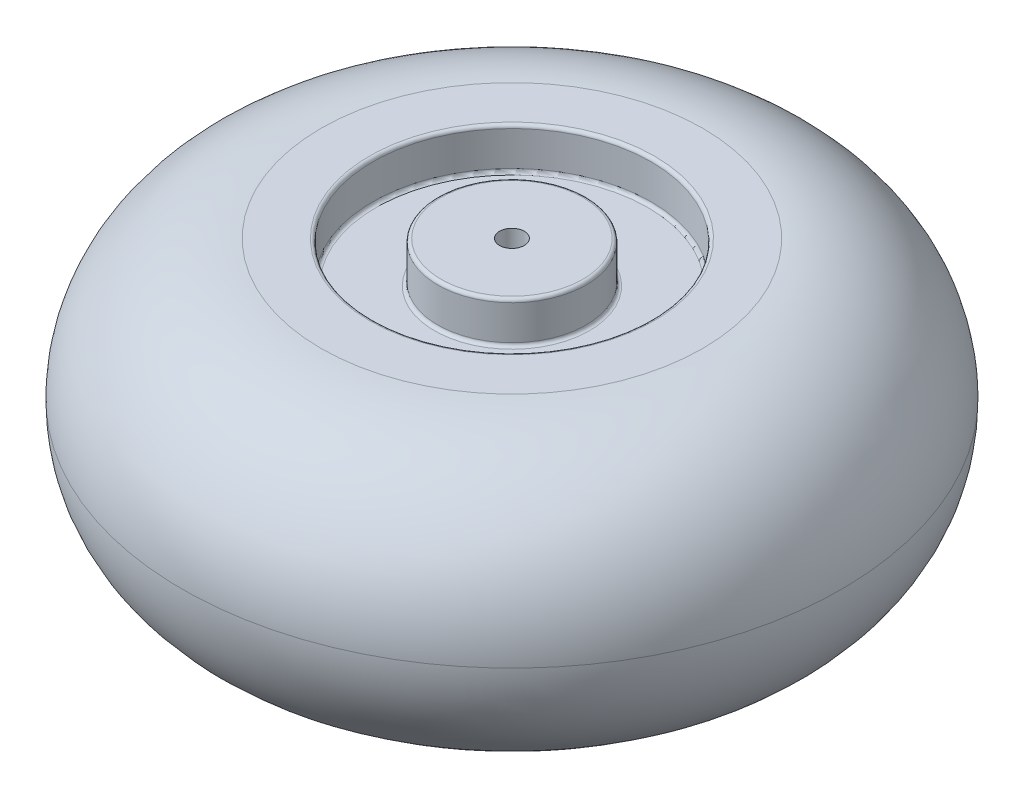
ISO-10303-21;
HEADER;
FILE_DESCRIPTION(('STEP AP214'),'2;1');
FILE_NAME('part.step','',(''),(''),'','','');
FILE_SCHEMA(('AUTOMOTIVE_DESIGN { 1 0 10303 214 1 1 1 1 }'));
ENDSEC;
DATA;
#1=APPLICATION_CONTEXT('core data for automotive mechanical design processes');
#2=APPLICATION_PROTOCOL_DEFINITION('international standard','automotive_design',2000,#1);
#3=PRODUCT_CONTEXT('',#1,'mechanical');
#4=PRODUCT('Part','Part','',(#3));
#5=PRODUCT_RELATED_PRODUCT_CATEGORY('part','',(#4));
#6=PRODUCT_DEFINITION_FORMATION('','',#4);
#7=PRODUCT_DEFINITION_CONTEXT('part definition',#1,'design');
#8=PRODUCT_DEFINITION('design','',#6,#7);
#9=PRODUCT_DEFINITION_SHAPE('','',#8);
#10=(LENGTH_UNIT() NAMED_UNIT(*) SI_UNIT(.MILLI.,.METRE.));
#11=(NAMED_UNIT(*) PLANE_ANGLE_UNIT() SI_UNIT($,.RADIAN.));
#12=(NAMED_UNIT(*) SI_UNIT($,.STERADIAN.) SOLID_ANGLE_UNIT());
#13=UNCERTAINTY_MEASURE_WITH_UNIT(LENGTH_MEASURE(1.E-05),#10,'distance_accuracy_value','');
#14=(GEOMETRIC_REPRESENTATION_CONTEXT(3) GLOBAL_UNCERTAINTY_ASSIGNED_CONTEXT((#13)) GLOBAL_UNIT_ASSIGNED_CONTEXT((#10,
#11,#12)) REPRESENTATION_CONTEXT('',''));
#15=CARTESIAN_POINT('',(0.,0.,0.));
#16=DIRECTION('',(0.,0.,1.));
#17=DIRECTION('',(1.,0.,0.));
#18=AXIS2_PLACEMENT_3D('',#15,#16,#17);
#19=CARTESIAN_POINT('',(0.,67.5,-6.));
#20=DIRECTION('',(0.,1.,0.));
#21=DIRECTION('',(0.,0.,1.));
#22=AXIS2_PLACEMENT_3D('',#19,#20,#21);
#23=PLANE('',#22);
#24=CARTESIAN_POINT('',(0.,67.5,0.));
#25=DIRECTION('',(0.,-1.,0.));
#26=DIRECTION('',(0.,0.,-1.));
#27=AXIS2_PLACEMENT_3D('',#24,#25,#26);
#28=CIRCLE('',#27,6.);
#29=CARTESIAN_POINT('',(0.,67.5,-6.));
#30=VERTEX_POINT('',#29);
#31=EDGE_CURVE('E104',#30,#30,#28,.T.);
#32=ORIENTED_EDGE('',*,*,#31,.T.);
#33=EDGE_LOOP('',(#32));
#34=FACE_BOUND('',#33,.T.);
#35=CARTESIAN_POINT('',(0.,67.5,0.));
#36=DIRECTION('',(0.,-1.,0.));
#37=DIRECTION('',(0.,0.,-1.));
#38=AXIS2_PLACEMENT_3D('',#35,#36,#37);
#39=CIRCLE('',#38,34.3864252617363);
#40=CARTESIAN_POINT('',(0.,67.5,-34.3864252617363));
#41=VERTEX_POINT('',#40);
#42=EDGE_CURVE('E10',#41,#41,#39,.T.);
#43=ORIENTED_EDGE('',*,*,#42,.F.);
#44=EDGE_LOOP('',(#43));
#45=FACE_BOUND('',#44,.T.);
#46=ADVANCED_FACE('F37',(#34,#45),#23,.T.);
#47=CARTESIAN_POINT('',(0.,65.8864252617363,0.));
#48=DIRECTION('',(0.,-1.,0.));
#49=DIRECTION('',(0.,0.,-1.));
#50=AXIS2_PLACEMENT_3D('',#47,#48,#49);
#51=TOROIDAL_SURFACE('',#50,34.3864252617363,1.61357473826371);
#52=ORIENTED_EDGE('',*,*,#42,.T.);
#53=EDGE_LOOP('',(#52));
#54=FACE_BOUND('',#53,.T.);
#55=CARTESIAN_POINT('',(0.,65.8864252617363,0.));
#56=DIRECTION('',(0.,-1.,0.));
#57=DIRECTION('',(0.,0.,-1.));
#58=AXIS2_PLACEMENT_3D('',#55,#56,#57);
#59=CIRCLE('',#58,36.);
#60=CARTESIAN_POINT('',(0.,65.8864252617363,-36.));
#61=VERTEX_POINT('',#60);
#62=EDGE_CURVE('E43',#61,#61,#59,.T.);
#63=ORIENTED_EDGE('',*,*,#62,.F.);
#64=EDGE_LOOP('',(#63));
#65=FACE_BOUND('',#64,.T.);
#66=ADVANCED_FACE('F122',(#54,#65),#51,.T.);
#67=CARTESIAN_POINT('',(0.,0.,0.));
#68=DIRECTION('',(0.,-1.,0.));
#69=DIRECTION('',(0.,0.,-1.));
#70=AXIS2_PLACEMENT_3D('',#67,#68,#69);
#71=CYLINDRICAL_SURFACE('',#70,36.);
#72=ORIENTED_EDGE('',*,*,#62,.T.);
#73=EDGE_LOOP('',(#72));
#74=FACE_BOUND('',#73,.T.);
#75=CARTESIAN_POINT('',(0.,49.1135747382637,0.));
#76=DIRECTION('',(0.,-1.,0.));
#77=DIRECTION('',(0.,0.,-1.));
#78=AXIS2_PLACEMENT_3D('',#75,#76,#77);
#79=CIRCLE('',#78,36.);
#80=CARTESIAN_POINT('',(0.,49.1135747382637,-36.));
#81=VERTEX_POINT('',#80);
#82=EDGE_CURVE('E47',#81,#81,#79,.T.);
#83=ORIENTED_EDGE('',*,*,#82,.F.);
#84=EDGE_LOOP('',(#83));
#85=FACE_BOUND('',#84,.T.);
#86=ADVANCED_FACE('F126',(#74,#85),#71,.T.);
#87=CARTESIAN_POINT('',(0.,49.1135747382637,0.));
#88=DIRECTION('',(0.,-1.,0.));
#89=DIRECTION('',(0.,0.,-1.));
#90=AXIS2_PLACEMENT_3D('',#87,#88,#89);
#91=TOROIDAL_SURFACE('',#90,37.6135747382637,1.6135747382637);
#92=ORIENTED_EDGE('',*,*,#82,.T.);
#93=EDGE_LOOP('',(#92));
#94=FACE_BOUND('',#93,.T.);
#95=CARTESIAN_POINT('',(0.,47.5,0.));
#96=DIRECTION('',(0.,-1.,0.));
#97=DIRECTION('',(0.,0.,-1.));
#98=AXIS2_PLACEMENT_3D('',#95,#96,#97);
#99=CIRCLE('',#98,37.6135747382637);
#100=CARTESIAN_POINT('',(0.,47.5,-37.6135747382637));
#101=VERTEX_POINT('',#100);
#102=EDGE_CURVE('E51',#101,#101,#99,.T.);
#103=ORIENTED_EDGE('',*,*,#102,.F.);
#104=EDGE_LOOP('',(#103));
#105=FACE_BOUND('',#104,.T.);
#106=ADVANCED_FACE('F130',(#94,#105),#91,.F.);
#107=CARTESIAN_POINT('',(0.,47.5,-37.6135747382637));
#108=DIRECTION('',(0.,1.,0.));
#109=DIRECTION('',(0.,0.,1.));
#110=AXIS2_PLACEMENT_3D('',#107,#108,#109);
#111=PLANE('',#110);
#112=ORIENTED_EDGE('',*,*,#102,.T.);
#113=EDGE_LOOP('',(#112));
#114=FACE_BOUND('',#113,.T.);
#115=CARTESIAN_POINT('',(0.,47.5,0.));
#116=DIRECTION('',(0.,-1.,0.));
#117=DIRECTION('',(0.,0.,-1.));
#118=AXIS2_PLACEMENT_3D('',#115,#116,#117);
#119=CIRCLE('',#118,65.9196229294904);
#120=CARTESIAN_POINT('',(0.,47.5,-65.9196229294904));
#121=VERTEX_POINT('',#120);
#122=EDGE_CURVE('E56',#121,#121,#119,.T.);
#123=ORIENTED_EDGE('',*,*,#122,.F.);
#124=EDGE_LOOP('',(#123));
#125=FACE_BOUND('',#124,.T.);
#126=ADVANCED_FACE('F136',(#114,#125),#111,.T.);
#127=CARTESIAN_POINT('',(0.,49.1135747382637,0.));
#128=DIRECTION('',(0.,-1.,0.));
#129=DIRECTION('',(0.,0.,-1.));
#130=AXIS2_PLACEMENT_3D('',#127,#128,#129);
#131=TOROIDAL_SURFACE('',#130,65.9196229294904,1.61357473826371);
#132=ORIENTED_EDGE('',*,*,#122,.T.);
#133=EDGE_LOOP('',(#132));
#134=FACE_BOUND('',#133,.T.);
#135=CARTESIAN_POINT('',(0.,49.1135747382637,0.));
#136=DIRECTION('',(0.,-1.,0.));
#137=DIRECTION('',(0.,0.,-1.));
#138=AXIS2_PLACEMENT_3D('',#135,#136,#137);
#139=CIRCLE('',#138,67.5331976677541);
#140=CARTESIAN_POINT('',(0.,49.1135747382637,-67.5331976677541));
#141=VERTEX_POINT('',#140);
#142=EDGE_CURVE('E59',#141,#141,#139,.T.);
#143=ORIENTED_EDGE('',*,*,#142,.F.);
#144=EDGE_LOOP('',(#143));
#145=FACE_BOUND('',#144,.T.);
#146=ADVANCED_FACE('F140',(#134,#145),#131,.F.);
#147=CARTESIAN_POINT('',(0.,0.,0.));
#148=DIRECTION('',(0.,-1.,0.));
#149=DIRECTION('',(0.,0.,-1.));
#150=AXIS2_PLACEMENT_3D('',#147,#148,#149);
#151=CYLINDRICAL_SURFACE('',#150,67.5331976677541);
#152=ORIENTED_EDGE('',*,*,#142,.T.);
#153=EDGE_LOOP('',(#152));
#154=FACE_BOUND('',#153,.T.);
#155=CARTESIAN_POINT('',(0.,65.8864252617363,0.));
#156=DIRECTION('',(0.,-1.,0.));
#157=DIRECTION('',(0.,0.,-1.));
#158=AXIS2_PLACEMENT_3D('',#155,#156,#157);
#159=CIRCLE('',#158,67.5331976677541);
#160=CARTESIAN_POINT('',(0.,65.8864252617363,-67.5331976677541));
#161=VERTEX_POINT('',#160);
#162=EDGE_CURVE('E62',#161,#161,#159,.T.);
#163=ORIENTED_EDGE('',*,*,#162,.F.);
#164=EDGE_LOOP('',(#163));
#165=FACE_BOUND('',#164,.T.);
#166=ADVANCED_FACE('F144',(#154,#165),#151,.F.);
#167=CARTESIAN_POINT('',(0.,65.8864252617363,0.));
#168=DIRECTION('',(0.,-1.,0.));
#169=DIRECTION('',(0.,0.,-1.));
#170=AXIS2_PLACEMENT_3D('',#167,#168,#169);
#171=TOROIDAL_SURFACE('',#170,69.1467724060178,1.61357473826371);
#172=ORIENTED_EDGE('',*,*,#162,.T.);
#173=EDGE_LOOP('',(#172));
#174=FACE_BOUND('',#173,.T.);
#175=CARTESIAN_POINT('',(0.,67.5,0.));
#176=DIRECTION('',(0.,-1.,0.));
#177=DIRECTION('',(0.,0.,-1.));
#178=AXIS2_PLACEMENT_3D('',#175,#176,#177);
#179=CIRCLE('',#178,69.1467724060178);
#180=CARTESIAN_POINT('',(0.,67.5,-69.1467724060178));
#181=VERTEX_POINT('',#180);
#182=EDGE_CURVE('E65',#181,#181,#179,.T.);
#183=ORIENTED_EDGE('',*,*,#182,.F.);
#184=EDGE_LOOP('',(#183));
#185=FACE_BOUND('',#184,.T.);
#186=ADVANCED_FACE('F148',(#174,#185),#171,.T.);
#187=CARTESIAN_POINT('',(0.,67.5,-69.1467724060178));
#188=DIRECTION('',(0.,1.,0.));
#189=DIRECTION('',(0.,0.,1.));
#190=AXIS2_PLACEMENT_3D('',#187,#188,#189);
#191=PLANE('',#190);
#192=ORIENTED_EDGE('',*,*,#182,.T.);
#193=EDGE_LOOP('',(#192));
#194=FACE_BOUND('',#193,.T.);
#195=CARTESIAN_POINT('',(0.,67.5,0.));
#196=DIRECTION('',(0.,-1.,0.));
#197=DIRECTION('',(0.,0.,-1.));
#198=AXIS2_PLACEMENT_3D('',#195,#196,#197);
#199=CIRCLE('',#198,92.5331976677541);
#200=CARTESIAN_POINT('',(0.,67.5,-92.5331976677541));
#201=VERTEX_POINT('',#200);
#202=EDGE_CURVE('E68',#201,#201,#199,.T.);
#203=ORIENTED_EDGE('',*,*,#202,.F.);
#204=EDGE_LOOP('',(#203));
#205=FACE_BOUND('',#204,.T.);
#206=ADVANCED_FACE('F152',(#194,#205),#191,.T.);
#207=CARTESIAN_POINT('',(0.,0.175643854055496,0.));
#208=DIRECTION('',(0.,-1.,0.));
#209=DIRECTION('',(0.,0.,-1.));
#210=AXIS2_PLACEMENT_3D('',#207,#208,#209);
#211=TOROIDAL_SURFACE('',#210,92.5331976677541,67.3243561459445);
#212=ORIENTED_EDGE('',*,*,#202,.T.);
#213=EDGE_LOOP('',(#212));
#214=FACE_BOUND('',#213,.T.);
#215=CARTESIAN_POINT('',(0.,0.,0.));
#216=DIRECTION('',(0.,-1.,0.));
#217=DIRECTION('',(0.,0.,-1.));
#218=AXIS2_PLACEMENT_3D('',#215,#216,#217);
#219=CIRCLE('',#218,159.857324692934);
#220=CARTESIAN_POINT('',(0.,0.,-159.857324692934));
#221=VERTEX_POINT('',#220);
#222=EDGE_CURVE('E71',#221,#221,#219,.T.);
#223=ORIENTED_EDGE('',*,*,#222,.F.);
#224=EDGE_LOOP('',(#223));
#225=FACE_BOUND('',#224,.T.);
#226=ADVANCED_FACE('F156',(#214,#225),#211,.T.);
#227=CARTESIAN_POINT('',(0.,-0.175643854055496,0.));
#228=DIRECTION('',(0.,-1.,0.));
#229=DIRECTION('',(0.,0.,-1.));
#230=AXIS2_PLACEMENT_3D('',#227,#228,#229);
#231=TOROIDAL_SURFACE('',#230,92.5331976677541,67.3243561459445);
#232=ORIENTED_EDGE('',*,*,#222,.T.);
#233=EDGE_LOOP('',(#232));
#234=FACE_BOUND('',#233,.T.);
#235=CARTESIAN_POINT('',(0.,-67.5,0.));
#236=DIRECTION('',(0.,-1.,0.));
#237=DIRECTION('',(0.,0.,-1.));
#238=AXIS2_PLACEMENT_3D('',#235,#236,#237);
#239=CIRCLE('',#238,92.5331976677541);
#240=CARTESIAN_POINT('',(0.,-67.5,-92.5331976677541));
#241=VERTEX_POINT('',#240);
#242=EDGE_CURVE('E74',#241,#241,#239,.T.);
#243=ORIENTED_EDGE('',*,*,#242,.F.);
#244=EDGE_LOOP('',(#243));
#245=FACE_BOUND('',#244,.T.);
#246=ADVANCED_FACE('F160',(#234,#245),#231,.T.);
#247=CARTESIAN_POINT('',(0.,-67.5,-69.1467724060178));
#248=DIRECTION('',(0.,-1.,0.));
#249=DIRECTION('',(0.,0.,-1.));
#250=AXIS2_PLACEMENT_3D('',#247,#248,#249);
#251=PLANE('',#250);
#252=ORIENTED_EDGE('',*,*,#242,.T.);
#253=EDGE_LOOP('',(#252));
#254=FACE_BOUND('',#253,.T.);
#255=CARTESIAN_POINT('',(0.,-67.5,0.));
#256=DIRECTION('',(0.,-1.,0.));
#257=DIRECTION('',(0.,0.,-1.));
#258=AXIS2_PLACEMENT_3D('',#255,#256,#257);
#259=CIRCLE('',#258,69.1467724060178);
#260=CARTESIAN_POINT('',(0.,-67.5,-69.1467724060178));
#261=VERTEX_POINT('',#260);
#262=EDGE_CURVE('E77',#261,#261,#259,.T.);
#263=ORIENTED_EDGE('',*,*,#262,.F.);
#264=EDGE_LOOP('',(#263));
#265=FACE_BOUND('',#264,.T.);
#266=ADVANCED_FACE('F164',(#254,#265),#251,.T.);
#267=CARTESIAN_POINT('',(0.,-65.8864252617363,0.));
#268=DIRECTION('',(0.,-1.,0.));
#269=DIRECTION('',(0.,0.,-1.));
#270=AXIS2_PLACEMENT_3D('',#267,#268,#269);
#271=TOROIDAL_SURFACE('',#270,69.1467724060178,1.61357473826371);
#272=ORIENTED_EDGE('',*,*,#262,.T.);
#273=EDGE_LOOP('',(#272));
#274=FACE_BOUND('',#273,.T.);
#275=CARTESIAN_POINT('',(0.,-65.8864252617363,0.));
#276=DIRECTION('',(0.,-1.,0.));
#277=DIRECTION('',(0.,0.,-1.));
#278=AXIS2_PLACEMENT_3D('',#275,#276,#277);
#279=CIRCLE('',#278,67.5331976677541);
#280=CARTESIAN_POINT('',(0.,-65.8864252617363,-67.5331976677541));
#281=VERTEX_POINT('',#280);
#282=EDGE_CURVE('E80',#281,#281,#279,.T.);
#283=ORIENTED_EDGE('',*,*,#282,.F.);
#284=EDGE_LOOP('',(#283));
#285=FACE_BOUND('',#284,.T.);
#286=ADVANCED_FACE('F168',(#274,#285),#271,.T.);
#287=CARTESIAN_POINT('',(0.,0.,0.));
#288=DIRECTION('',(0.,-1.,0.));
#289=DIRECTION('',(0.,0.,-1.));
#290=AXIS2_PLACEMENT_3D('',#287,#288,#289);
#291=CYLINDRICAL_SURFACE('',#290,67.5331976677541);
#292=ORIENTED_EDGE('',*,*,#282,.T.);
#293=EDGE_LOOP('',(#292));
#294=FACE_BOUND('',#293,.T.);
#295=CARTESIAN_POINT('',(0.,-49.1135747382637,0.));
#296=DIRECTION('',(0.,-1.,0.));
#297=DIRECTION('',(0.,0.,-1.));
#298=AXIS2_PLACEMENT_3D('',#295,#296,#297);
#299=CIRCLE('',#298,67.5331976677541);
#300=CARTESIAN_POINT('',(0.,-49.1135747382637,-67.5331976677541));
#301=VERTEX_POINT('',#300);
#302=EDGE_CURVE('E83',#301,#301,#299,.T.);
#303=ORIENTED_EDGE('',*,*,#302,.F.);
#304=EDGE_LOOP('',(#303));
#305=FACE_BOUND('',#304,.T.);
#306=ADVANCED_FACE('F172',(#294,#305),#291,.F.);
#307=CARTESIAN_POINT('',(0.,-49.1135747382637,0.));
#308=DIRECTION('',(0.,-1.,0.));
#309=DIRECTION('',(0.,0.,-1.));
#310=AXIS2_PLACEMENT_3D('',#307,#308,#309);
#311=TOROIDAL_SURFACE('',#310,65.9196229294904,1.61357473826371);
#312=ORIENTED_EDGE('',*,*,#302,.T.);
#313=EDGE_LOOP('',(#312));
#314=FACE_BOUND('',#313,.T.);
#315=CARTESIAN_POINT('',(0.,-47.5,0.));
#316=DIRECTION('',(0.,-1.,0.));
#317=DIRECTION('',(0.,0.,-1.));
#318=AXIS2_PLACEMENT_3D('',#315,#316,#317);
#319=CIRCLE('',#318,65.9196229294904);
#320=CARTESIAN_POINT('',(0.,-47.5,-65.9196229294904));
#321=VERTEX_POINT('',#320);
#322=EDGE_CURVE('E86',#321,#321,#319,.T.);
#323=ORIENTED_EDGE('',*,*,#322,.F.);
#324=EDGE_LOOP('',(#323));
#325=FACE_BOUND('',#324,.T.);
#326=ADVANCED_FACE('F176',(#314,#325),#311,.F.);
#327=CARTESIAN_POINT('',(0.,-47.5,-37.6135747382637));
#328=DIRECTION('',(0.,-1.,0.));
#329=DIRECTION('',(0.,0.,-1.));
#330=AXIS2_PLACEMENT_3D('',#327,#328,#329);
#331=PLANE('',#330);
#332=ORIENTED_EDGE('',*,*,#322,.T.);
#333=EDGE_LOOP('',(#332));
#334=FACE_BOUND('',#333,.T.);
#335=CARTESIAN_POINT('',(0.,-47.5,0.));
#336=DIRECTION('',(0.,-1.,0.));
#337=DIRECTION('',(0.,0.,-1.));
#338=AXIS2_PLACEMENT_3D('',#335,#336,#337);
#339=CIRCLE('',#338,37.6135747382637);
#340=CARTESIAN_POINT('',(0.,-47.5,-37.6135747382637));
#341=VERTEX_POINT('',#340);
#342=EDGE_CURVE('E89',#341,#341,#339,.T.);
#343=ORIENTED_EDGE('',*,*,#342,.F.);
#344=EDGE_LOOP('',(#343));
#345=FACE_BOUND('',#344,.T.);
#346=ADVANCED_FACE('F180',(#334,#345),#331,.T.);
#347=CARTESIAN_POINT('',(0.,-49.1135747382637,0.));
#348=DIRECTION('',(0.,-1.,0.));
#349=DIRECTION('',(0.,0.,-1.));
#350=AXIS2_PLACEMENT_3D('',#347,#348,#349);
#351=TOROIDAL_SURFACE('',#350,37.6135747382637,1.6135747382637);
#352=ORIENTED_EDGE('',*,*,#342,.T.);
#353=EDGE_LOOP('',(#352));
#354=FACE_BOUND('',#353,.T.);
#355=CARTESIAN_POINT('',(0.,-49.1135747382637,0.));
#356=DIRECTION('',(0.,-1.,0.));
#357=DIRECTION('',(0.,0.,-1.));
#358=AXIS2_PLACEMENT_3D('',#355,#356,#357);
#359=CIRCLE('',#358,36.);
#360=CARTESIAN_POINT('',(0.,-49.1135747382637,-36.));
#361=VERTEX_POINT('',#360);
#362=EDGE_CURVE('E92',#361,#361,#359,.T.);
#363=ORIENTED_EDGE('',*,*,#362,.F.);
#364=EDGE_LOOP('',(#363));
#365=FACE_BOUND('',#364,.T.);
#366=ADVANCED_FACE('F184',(#354,#365),#351,.F.);
#367=CARTESIAN_POINT('',(0.,0.,0.));
#368=DIRECTION('',(0.,-1.,0.));
#369=DIRECTION('',(0.,0.,-1.));
#370=AXIS2_PLACEMENT_3D('',#367,#368,#369);
#371=CYLINDRICAL_SURFACE('',#370,36.);
#372=ORIENTED_EDGE('',*,*,#362,.T.);
#373=EDGE_LOOP('',(#372));
#374=FACE_BOUND('',#373,.T.);
#375=CARTESIAN_POINT('',(0.,-65.8864252617363,0.));
#376=DIRECTION('',(0.,-1.,0.));
#377=DIRECTION('',(0.,0.,-1.));
#378=AXIS2_PLACEMENT_3D('',#375,#376,#377);
#379=CIRCLE('',#378,36.);
#380=CARTESIAN_POINT('',(0.,-65.8864252617363,-36.));
#381=VERTEX_POINT('',#380);
#382=EDGE_CURVE('E95',#381,#381,#379,.T.);
#383=ORIENTED_EDGE('',*,*,#382,.F.);
#384=EDGE_LOOP('',(#383));
#385=FACE_BOUND('',#384,.T.);
#386=ADVANCED_FACE('F188',(#374,#385),#371,.T.);
#387=CARTESIAN_POINT('',(0.,-65.8864252617363,0.));
#388=DIRECTION('',(0.,-1.,0.));
#389=DIRECTION('',(0.,0.,-1.));
#390=AXIS2_PLACEMENT_3D('',#387,#388,#389);
#391=TOROIDAL_SURFACE('',#390,34.3864252617363,1.61357473826371);
#392=ORIENTED_EDGE('',*,*,#382,.T.);
#393=EDGE_LOOP('',(#392));
#394=FACE_BOUND('',#393,.T.);
#395=CARTESIAN_POINT('',(0.,-67.5,0.));
#396=DIRECTION('',(0.,-1.,0.));
#397=DIRECTION('',(0.,0.,-1.));
#398=AXIS2_PLACEMENT_3D('',#395,#396,#397);
#399=CIRCLE('',#398,34.3864252617363);
#400=CARTESIAN_POINT('',(0.,-67.5,-34.3864252617363));
#401=VERTEX_POINT('',#400);
#402=EDGE_CURVE('E98',#401,#401,#399,.T.);
#403=ORIENTED_EDGE('',*,*,#402,.F.);
#404=EDGE_LOOP('',(#403));
#405=FACE_BOUND('',#404,.T.);
#406=ADVANCED_FACE('F118',(#394,#405),#391,.T.);
#407=CARTESIAN_POINT('',(0.,-67.5,-6.));
#408=DIRECTION('',(0.,-1.,0.));
#409=DIRECTION('',(0.,0.,-1.));
#410=AXIS2_PLACEMENT_3D('',#407,#408,#409);
#411=PLANE('',#410);
#412=ORIENTED_EDGE('',*,*,#402,.T.);
#413=EDGE_LOOP('',(#412));
#414=FACE_BOUND('',#413,.T.);
#415=CARTESIAN_POINT('',(0.,-67.5,0.));
#416=DIRECTION('',(0.,-1.,0.));
#417=DIRECTION('',(0.,0.,-1.));
#418=AXIS2_PLACEMENT_3D('',#415,#416,#417);
#419=CIRCLE('',#418,6.);
#420=CARTESIAN_POINT('',(0.,-67.5,-6.));
#421=VERTEX_POINT('',#420);
#422=EDGE_CURVE('E101',#421,#421,#419,.T.);
#423=ORIENTED_EDGE('',*,*,#422,.F.);
#424=EDGE_LOOP('',(#423));
#425=FACE_BOUND('',#424,.T.);
#426=ADVANCED_FACE('F112',(#414,#425),#411,.T.);
#427=CARTESIAN_POINT('',(0.,0.,0.));
#428=DIRECTION('',(0.,-1.,0.));
#429=DIRECTION('',(0.,0.,-1.));
#430=AXIS2_PLACEMENT_3D('',#427,#428,#429);
#431=CYLINDRICAL_SURFACE('',#430,6.);
#432=ORIENTED_EDGE('',*,*,#422,.T.);
#433=EDGE_LOOP('',(#432));
#434=FACE_BOUND('',#433,.T.);
#435=ORIENTED_EDGE('',*,*,#31,.F.);
#436=EDGE_LOOP('',(#435));
#437=FACE_BOUND('',#436,.T.);
#438=ADVANCED_FACE('F110',(#434,#437),#431,.F.);
#439=CLOSED_SHELL('',(#46,#66,#86,#106,#126,#146,#166,#186,#206,#226,#246,#266,#286,#306,#326,
#346,#366,#386,#406,#426,#438));
#440=MANIFOLD_SOLID_BREP('B2',#439);
#441=ADVANCED_BREP_SHAPE_REPRESENTATION('',(#18,#440),#14);
#442=SHAPE_DEFINITION_REPRESENTATION(#9,#441);
ENDSEC;
END-ISO-10303-21;
